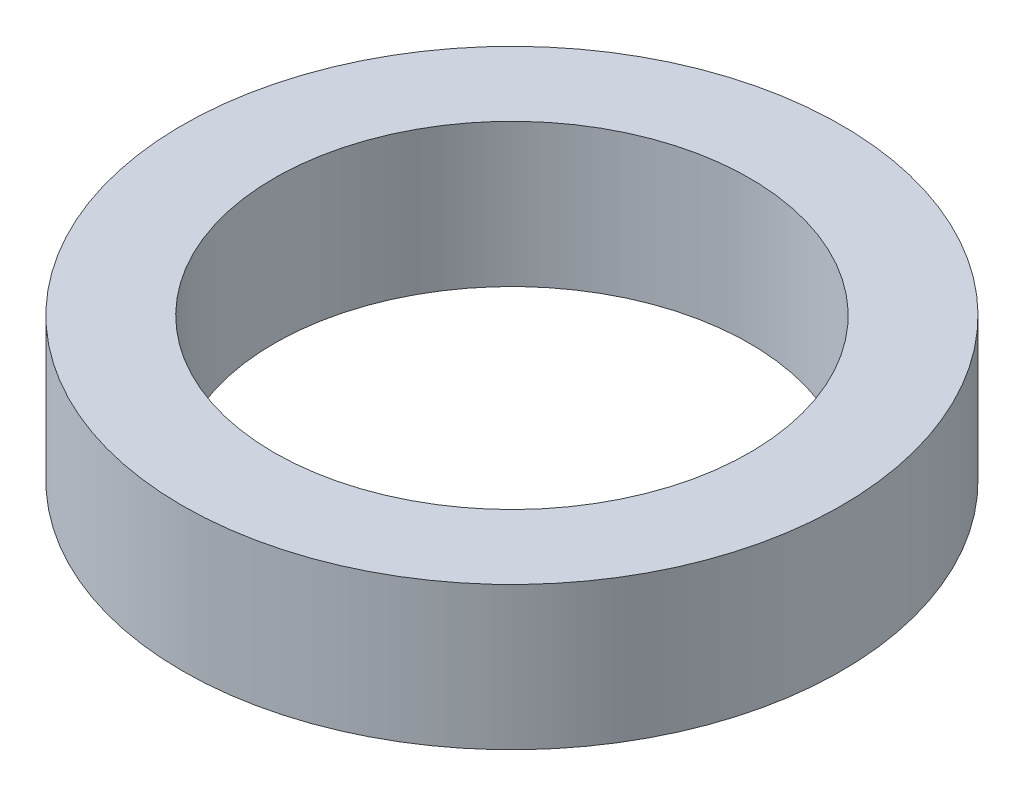
ISO-10303-21;
HEADER;
FILE_DESCRIPTION(('STEP AP214'),'2;1');
FILE_NAME('part.step','',(''),(''),'','','');
FILE_SCHEMA(('AUTOMOTIVE_DESIGN { 1 0 10303 214 1 1 1 1 }'));
ENDSEC;
DATA;
#1=APPLICATION_CONTEXT('core data for automotive mechanical design processes');
#2=APPLICATION_PROTOCOL_DEFINITION('international standard','automotive_design',2000,#1);
#3=PRODUCT_CONTEXT('',#1,'mechanical');
#4=PRODUCT('Part','Part','',(#3));
#5=PRODUCT_RELATED_PRODUCT_CATEGORY('part','',(#4));
#6=PRODUCT_DEFINITION_FORMATION('','',#4);
#7=PRODUCT_DEFINITION_CONTEXT('part definition',#1,'design');
#8=PRODUCT_DEFINITION('design','',#6,#7);
#9=PRODUCT_DEFINITION_SHAPE('','',#8);
#10=(LENGTH_UNIT() NAMED_UNIT(*) SI_UNIT(.MILLI.,.METRE.));
#11=(NAMED_UNIT(*) PLANE_ANGLE_UNIT() SI_UNIT($,.RADIAN.));
#12=(NAMED_UNIT(*) SI_UNIT($,.STERADIAN.) SOLID_ANGLE_UNIT());
#13=UNCERTAINTY_MEASURE_WITH_UNIT(LENGTH_MEASURE(1.E-05),#10,'distance_accuracy_value','');
#14=(GEOMETRIC_REPRESENTATION_CONTEXT(3) GLOBAL_UNCERTAINTY_ASSIGNED_CONTEXT((#13)) GLOBAL_UNIT_ASSIGNED_CONTEXT((#10,
#11,#12)) REPRESENTATION_CONTEXT('',''));
#15=CARTESIAN_POINT('',(0.,0.,0.));
#16=DIRECTION('',(0.,0.,1.));
#17=DIRECTION('',(1.,0.,0.));
#18=AXIS2_PLACEMENT_3D('',#15,#16,#17);
#19=CARTESIAN_POINT('',(0.,1.52,0.));
#20=DIRECTION('',(0.,1.,0.));
#21=DIRECTION('',(0.,0.,1.));
#22=AXIS2_PLACEMENT_3D('',#19,#20,#21);
#23=PLANE('',#22);
#24=CARTESIAN_POINT('',(0.,1.52,0.));
#25=DIRECTION('',(0.,1.,0.));
#26=DIRECTION('',(0.,0.,1.));
#27=AXIS2_PLACEMENT_3D('',#24,#25,#26);
#28=CIRCLE('',#27,3.5);
#29=CARTESIAN_POINT('',(0.,1.52,3.5));
#30=VERTEX_POINT('',#29);
#31=EDGE_CURVE('E10',#30,#30,#28,.T.);
#32=ORIENTED_EDGE('',*,*,#31,.T.);
#33=EDGE_LOOP('',(#32));
#34=FACE_BOUND('',#33,.T.);
#35=CARTESIAN_POINT('',(0.,1.52,0.));
#36=DIRECTION('',(0.,1.,0.));
#37=DIRECTION('',(0.,0.,1.));
#38=AXIS2_PLACEMENT_3D('',#35,#36,#37);
#39=CIRCLE('',#38,2.525);
#40=CARTESIAN_POINT('',(0.,1.52,2.525));
#41=VERTEX_POINT('',#40);
#42=EDGE_CURVE('E43',#41,#41,#39,.T.);
#43=ORIENTED_EDGE('',*,*,#42,.F.);
#44=EDGE_LOOP('',(#43));
#45=FACE_BOUND('',#44,.T.);
#46=ADVANCED_FACE('F32',(#34,#45),#23,.T.);
#47=CARTESIAN_POINT('',(0.,0.,0.));
#48=DIRECTION('',(0.,1.,0.));
#49=DIRECTION('',(0.,0.,1.));
#50=AXIS2_PLACEMENT_3D('',#47,#48,#49);
#51=PLANE('',#50);
#52=CARTESIAN_POINT('',(0.,0.,0.));
#53=DIRECTION('',(0.,1.,0.));
#54=DIRECTION('',(0.,0.,1.));
#55=AXIS2_PLACEMENT_3D('',#52,#53,#54);
#56=CIRCLE('',#55,3.5);
#57=CARTESIAN_POINT('',(0.,0.,3.5));
#58=VERTEX_POINT('',#57);
#59=EDGE_CURVE('E36',#58,#58,#56,.T.);
#60=ORIENTED_EDGE('',*,*,#59,.F.);
#61=EDGE_LOOP('',(#60));
#62=FACE_BOUND('',#61,.T.);
#63=CARTESIAN_POINT('',(0.,0.,0.));
#64=DIRECTION('',(0.,1.,0.));
#65=DIRECTION('',(0.,0.,1.));
#66=AXIS2_PLACEMENT_3D('',#63,#64,#65);
#67=CIRCLE('',#66,2.525);
#68=CARTESIAN_POINT('',(0.,0.,2.525));
#69=VERTEX_POINT('',#68);
#70=EDGE_CURVE('E45',#69,#69,#67,.T.);
#71=ORIENTED_EDGE('',*,*,#70,.T.);
#72=EDGE_LOOP('',(#71));
#73=FACE_BOUND('',#72,.T.);
#74=ADVANCED_FACE('F55',(#62,#73),#51,.F.);
#75=CARTESIAN_POINT('',(0.,1.52,0.));
#76=DIRECTION('',(0.,-1.,0.));
#77=DIRECTION('',(0.,0.,-1.));
#78=AXIS2_PLACEMENT_3D('',#75,#76,#77);
#79=CYLINDRICAL_SURFACE('',#78,3.5);
#80=ORIENTED_EDGE('',*,*,#31,.F.);
#81=EDGE_LOOP('',(#80));
#82=FACE_BOUND('',#81,.T.);
#83=ORIENTED_EDGE('',*,*,#59,.T.);
#84=EDGE_LOOP('',(#83));
#85=FACE_BOUND('',#84,.T.);
#86=ADVANCED_FACE('F34',(#82,#85),#79,.T.);
#87=CARTESIAN_POINT('',(0.,1.52,0.));
#88=DIRECTION('',(0.,-1.,0.));
#89=DIRECTION('',(0.,0.,-1.));
#90=AXIS2_PLACEMENT_3D('',#87,#88,#89);
#91=CYLINDRICAL_SURFACE('',#90,2.525);
#92=ORIENTED_EDGE('',*,*,#42,.T.);
#93=EDGE_LOOP('',(#92));
#94=FACE_BOUND('',#93,.T.);
#95=ORIENTED_EDGE('',*,*,#70,.F.);
#96=EDGE_LOOP('',(#95));
#97=FACE_BOUND('',#96,.T.);
#98=ADVANCED_FACE('F51',(#94,#97),#91,.F.);
#99=CLOSED_SHELL('',(#46,#74,#86,#98));
#100=MANIFOLD_SOLID_BREP('B2',#99);
#101=ADVANCED_BREP_SHAPE_REPRESENTATION('',(#18,#100),#14);
#102=SHAPE_DEFINITION_REPRESENTATION(#9,#101);
ENDSEC;
END-ISO-10303-21;
